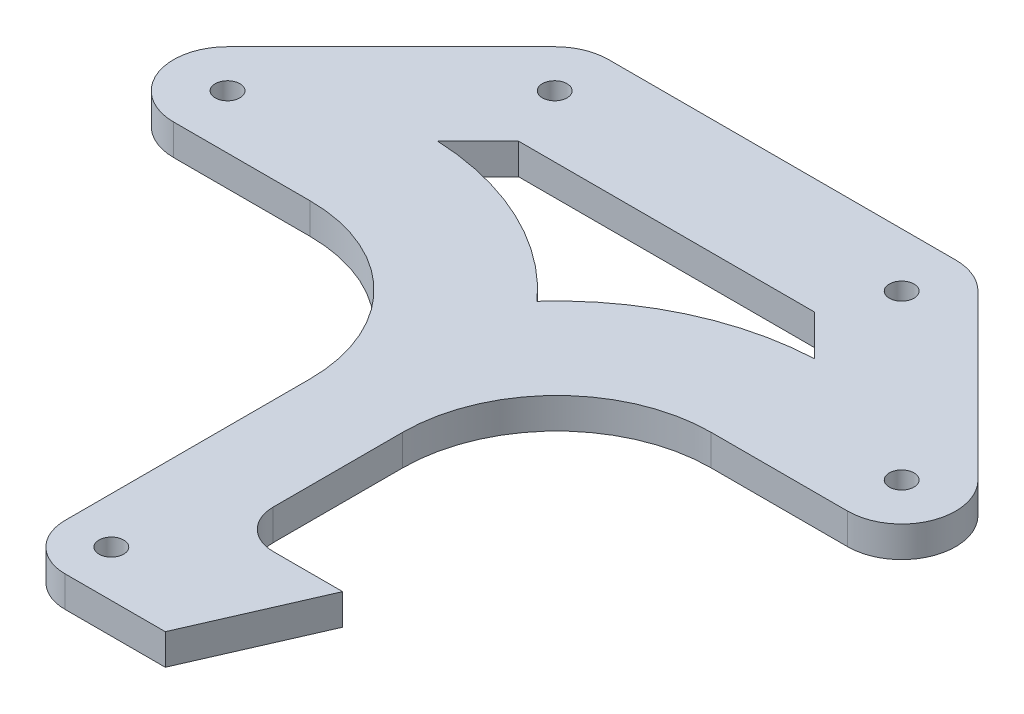
ISO-10303-21;
HEADER;
FILE_DESCRIPTION(('STEP AP214'),'2;1');
FILE_NAME('part.step','',(''),(''),'','','');
FILE_SCHEMA(('AUTOMOTIVE_DESIGN { 1 0 10303 214 1 1 1 1 }'));
ENDSEC;
DATA;
#1=APPLICATION_CONTEXT('core data for automotive mechanical design processes');
#2=APPLICATION_PROTOCOL_DEFINITION('international standard','automotive_design',2000,#1);
#3=PRODUCT_CONTEXT('',#1,'mechanical');
#4=PRODUCT('Part','Part','',(#3));
#5=PRODUCT_RELATED_PRODUCT_CATEGORY('part','',(#4));
#6=PRODUCT_DEFINITION_FORMATION('','',#4);
#7=PRODUCT_DEFINITION_CONTEXT('part definition',#1,'design');
#8=PRODUCT_DEFINITION('design','',#6,#7);
#9=PRODUCT_DEFINITION_SHAPE('','',#8);
#10=(LENGTH_UNIT() NAMED_UNIT(*) SI_UNIT(.MILLI.,.METRE.));
#11=(NAMED_UNIT(*) PLANE_ANGLE_UNIT() SI_UNIT($,.RADIAN.));
#12=(NAMED_UNIT(*) SI_UNIT($,.STERADIAN.) SOLID_ANGLE_UNIT());
#13=UNCERTAINTY_MEASURE_WITH_UNIT(LENGTH_MEASURE(1.E-05),#10,'distance_accuracy_value','');
#14=(GEOMETRIC_REPRESENTATION_CONTEXT(3) GLOBAL_UNCERTAINTY_ASSIGNED_CONTEXT((#13)) GLOBAL_UNIT_ASSIGNED_CONTEXT((#10,
#11,#12)) REPRESENTATION_CONTEXT('',''));
#15=CARTESIAN_POINT('',(0.,0.,0.));
#16=DIRECTION('',(0.,0.,1.));
#17=DIRECTION('',(1.,0.,0.));
#18=AXIS2_PLACEMENT_3D('',#15,#16,#17);
#19=CARTESIAN_POINT('',(0.,4.,-10.));
#20=DIRECTION('',(0.,0.,-1.));
#21=DIRECTION('',(-1.,0.,0.));
#22=AXIS2_PLACEMENT_3D('',#19,#20,#21);
#23=PLANE('',#22);
#24=DIRECTION('',(1.,0.,0.));
#25=VECTOR('',#24,1.);
#26=CARTESIAN_POINT('',(0.,0.,-10.));
#27=LINE('',#26,#25);
#28=CARTESIAN_POINT('',(11.,0.,-10.));
#29=VERTEX_POINT('',#28);
#30=CARTESIAN_POINT('',(20.,0.,-10.));
#31=VERTEX_POINT('',#30);
#32=EDGE_CURVE('E258',#29,#31,#27,.T.);
#33=ORIENTED_EDGE('',*,*,#32,.F.);
#34=DIRECTION('',(0.,-1.,0.));
#35=VECTOR('',#34,1.);
#36=CARTESIAN_POINT('',(11.,4.,-10.));
#37=LINE('',#36,#35);
#38=CARTESIAN_POINT('',(11.,4.,-10.));
#39=VERTEX_POINT('',#38);
#40=EDGE_CURVE('E11',#39,#29,#37,.T.);
#41=ORIENTED_EDGE('',*,*,#40,.F.);
#42=DIRECTION('',(1.,0.,0.));
#43=VECTOR('',#42,1.);
#44=CARTESIAN_POINT('',(0.,4.,-10.));
#45=LINE('',#44,#43);
#46=CARTESIAN_POINT('',(20.,4.,-10.));
#47=VERTEX_POINT('',#46);
#48=EDGE_CURVE('E390',#39,#47,#45,.T.);
#49=ORIENTED_EDGE('',*,*,#48,.T.);
#50=DIRECTION('',(0.,-1.,0.));
#51=VECTOR('',#50,1.);
#52=CARTESIAN_POINT('',(20.,4.,-10.));
#53=LINE('',#52,#51);
#54=EDGE_CURVE('E56',#47,#31,#53,.T.);
#55=ORIENTED_EDGE('',*,*,#54,.T.);
#56=EDGE_LOOP('',(#33,#41,#49,#55));
#57=FACE_BOUND('',#56,.T.);
#58=ADVANCED_FACE('F37',(#57),#23,.T.);
#59=CARTESIAN_POINT('',(11.,4.,-15.));
#60=DIRECTION('',(0.,-1.,0.));
#61=DIRECTION('',(0.,0.,-1.));
#62=AXIS2_PLACEMENT_3D('',#59,#60,#61);
#63=CYLINDRICAL_SURFACE('',#62,5.);
#64=CARTESIAN_POINT('',(11.,0.,-15.));
#65=DIRECTION('',(0.,1.,0.));
#66=DIRECTION('',(0.,0.,1.));
#67=AXIS2_PLACEMENT_3D('',#64,#65,#66);
#68=CIRCLE('',#67,5.);
#69=CARTESIAN_POINT('',(6.00000000000001,0.,-15.));
#70=VERTEX_POINT('',#69);
#71=EDGE_CURVE('E260',#29,#70,#68,.F.);
#72=ORIENTED_EDGE('',*,*,#71,.T.);
#73=DIRECTION('',(0.,-1.,0.));
#74=VECTOR('',#73,1.);
#75=CARTESIAN_POINT('',(6.00000000000001,4.,-15.));
#76=LINE('',#75,#74);
#77=CARTESIAN_POINT('',(6.00000000000001,4.,-15.));
#78=VERTEX_POINT('',#77);
#79=EDGE_CURVE('E47',#78,#70,#76,.T.);
#80=ORIENTED_EDGE('',*,*,#79,.F.);
#81=CARTESIAN_POINT('',(11.,4.,-15.));
#82=DIRECTION('',(0.,1.,0.));
#83=DIRECTION('',(0.,0.,1.));
#84=AXIS2_PLACEMENT_3D('',#81,#82,#83);
#85=CIRCLE('',#84,5.);
#86=EDGE_CURVE('E396',#39,#78,#85,.F.);
#87=ORIENTED_EDGE('',*,*,#86,.F.);
#88=ORIENTED_EDGE('',*,*,#40,.T.);
#89=EDGE_LOOP('',(#72,#80,#87,#88));
#90=FACE_BOUND('',#89,.T.);
#91=ADVANCED_FACE('F455',(#90),#63,.F.);
#92=CARTESIAN_POINT('',(6.00000000000002,4.,0.));
#93=DIRECTION('',(1.,0.,0.));
#94=DIRECTION('',(0.,0.,-1.));
#95=AXIS2_PLACEMENT_3D('',#92,#93,#94);
#96=PLANE('',#95);
#97=DIRECTION('',(0.,0.,1.));
#98=VECTOR('',#97,1.);
#99=CARTESIAN_POINT('',(6.00000000000002,0.,0.));
#100=LINE('',#99,#98);
#101=CARTESIAN_POINT('',(6.,0.,-31.7867965644037));
#102=VERTEX_POINT('',#101);
#103=EDGE_CURVE('E263',#102,#70,#100,.T.);
#104=ORIENTED_EDGE('',*,*,#103,.F.);
#105=DIRECTION('',(0.,-1.,0.));
#106=VECTOR('',#105,1.);
#107=CARTESIAN_POINT('',(6.,4.,-31.7867965644037));
#108=LINE('',#107,#106);
#109=CARTESIAN_POINT('',(6.,4.,-31.7867965644037));
#110=VERTEX_POINT('',#109);
#111=EDGE_CURVE('E352',#110,#102,#108,.T.);
#112=ORIENTED_EDGE('',*,*,#111,.F.);
#113=DIRECTION('',(0.,0.,1.));
#114=VECTOR('',#113,1.);
#115=CARTESIAN_POINT('',(6.00000000000002,4.,0.));
#116=LINE('',#115,#114);
#117=EDGE_CURVE('E398',#110,#78,#116,.T.);
#118=ORIENTED_EDGE('',*,*,#117,.T.);
#119=ORIENTED_EDGE('',*,*,#79,.T.);
#120=EDGE_LOOP('',(#104,#112,#118,#119));
#121=FACE_BOUND('',#120,.T.);
#122=ADVANCED_FACE('F460',(#121),#96,.T.);
#123=CARTESIAN_POINT('',(26.,4.,-31.7867965644037));
#124=DIRECTION('',(0.,-1.,0.));
#125=DIRECTION('',(0.,0.,-1.));
#126=AXIS2_PLACEMENT_3D('',#123,#124,#125);
#127=CYLINDRICAL_SURFACE('',#126,20.);
#128=CARTESIAN_POINT('',(26.,0.,-31.7867965644037));
#129=DIRECTION('',(0.,1.,0.));
#130=DIRECTION('',(0.,0.,1.));
#131=AXIS2_PLACEMENT_3D('',#128,#129,#130);
#132=CIRCLE('',#131,20.);
#133=CARTESIAN_POINT('',(26.,0.,-51.7867965644037));
#134=VERTEX_POINT('',#133);
#135=EDGE_CURVE('E266',#134,#102,#132,.T.);
#136=ORIENTED_EDGE('',*,*,#135,.F.);
#137=DIRECTION('',(0.,-1.,0.));
#138=VECTOR('',#137,1.);
#139=CARTESIAN_POINT('',(26.,4.,-51.7867965644037));
#140=LINE('',#139,#138);
#141=CARTESIAN_POINT('',(26.,4.,-51.7867965644037));
#142=VERTEX_POINT('',#141);
#143=EDGE_CURVE('E350',#142,#134,#140,.T.);
#144=ORIENTED_EDGE('',*,*,#143,.F.);
#145=CARTESIAN_POINT('',(26.,4.,-31.7867965644037));
#146=DIRECTION('',(0.,1.,0.));
#147=DIRECTION('',(0.,0.,1.));
#148=AXIS2_PLACEMENT_3D('',#145,#146,#147);
#149=CIRCLE('',#148,20.);
#150=EDGE_CURVE('E401',#142,#110,#149,.T.);
#151=ORIENTED_EDGE('',*,*,#150,.T.);
#152=ORIENTED_EDGE('',*,*,#111,.T.);
#153=EDGE_LOOP('',(#136,#144,#151,#152));
#154=FACE_BOUND('',#153,.T.);
#155=ADVANCED_FACE('F699',(#154),#127,.F.);
#156=CARTESIAN_POINT('',(0.,4.,-51.7867965644037));
#157=DIRECTION('',(0.,0.,-1.));
#158=DIRECTION('',(-1.,0.,0.));
#159=AXIS2_PLACEMENT_3D('',#156,#157,#158);
#160=PLANE('',#159);
#161=DIRECTION('',(1.,0.,0.));
#162=VECTOR('',#161,1.);
#163=CARTESIAN_POINT('',(0.,0.,-51.7867965644037));
#164=LINE('',#163,#162);
#165=CARTESIAN_POINT('',(43.7132034355966,0.,-51.7867965644037));
#166=VERTEX_POINT('',#165);
#167=EDGE_CURVE('E269',#134,#166,#164,.T.);
#168=ORIENTED_EDGE('',*,*,#167,.T.);
#169=DIRECTION('',(0.,-1.,0.));
#170=VECTOR('',#169,1.);
#171=CARTESIAN_POINT('',(43.7132034355966,4.,-51.7867965644037));
#172=LINE('',#171,#170);
#173=CARTESIAN_POINT('',(43.7132034355966,4.,-51.7867965644037));
#174=VERTEX_POINT('',#173);
#175=EDGE_CURVE('E347',#174,#166,#172,.T.);
#176=ORIENTED_EDGE('',*,*,#175,.F.);
#177=DIRECTION('',(1.,0.,0.));
#178=VECTOR('',#177,1.);
#179=CARTESIAN_POINT('',(0.,4.,-51.7867965644037));
#180=LINE('',#179,#178);
#181=EDGE_CURVE('E404',#142,#174,#180,.T.);
#182=ORIENTED_EDGE('',*,*,#181,.F.);
#183=ORIENTED_EDGE('',*,*,#143,.T.);
#184=EDGE_LOOP('',(#168,#176,#182,#183));
#185=FACE_BOUND('',#184,.T.);
#186=ADVANCED_FACE('F690',(#185),#160,.F.);
#187=CARTESIAN_POINT('',(43.7132034355966,4.,-58.7867965644037));
#188=DIRECTION('',(0.,-1.,0.));
#189=DIRECTION('',(0.,0.,-1.));
#190=AXIS2_PLACEMENT_3D('',#187,#188,#189);
#191=CYLINDRICAL_SURFACE('',#190,7.00000000000003);
#192=CARTESIAN_POINT('',(43.7132034355966,0.,-58.7867965644037));
#193=DIRECTION('',(0.,1.,0.));
#194=DIRECTION('',(0.,0.,1.));
#195=AXIS2_PLACEMENT_3D('',#192,#193,#194);
#196=CIRCLE('',#195,7.00000000000003);
#197=CARTESIAN_POINT('',(48.6629509039024,0.,-63.7365440327096));
#198=VERTEX_POINT('',#197);
#199=EDGE_CURVE('E272',#166,#198,#196,.T.);
#200=ORIENTED_EDGE('',*,*,#199,.T.);
#201=DIRECTION('',(0.,-1.,0.));
#202=VECTOR('',#201,1.);
#203=CARTESIAN_POINT('',(48.6629509039024,4.,-63.7365440327096));
#204=LINE('',#203,#202);
#205=CARTESIAN_POINT('',(48.6629509039024,4.,-63.7365440327096));
#206=VERTEX_POINT('',#205);
#207=EDGE_CURVE('E344',#206,#198,#204,.T.);
#208=ORIENTED_EDGE('',*,*,#207,.F.);
#209=CARTESIAN_POINT('',(43.7132034355966,4.,-58.7867965644037));
#210=DIRECTION('',(0.,1.,0.));
#211=DIRECTION('',(0.,0.,1.));
#212=AXIS2_PLACEMENT_3D('',#209,#210,#211);
#213=CIRCLE('',#212,7.00000000000003);
#214=EDGE_CURVE('E407',#174,#206,#213,.T.);
#215=ORIENTED_EDGE('',*,*,#214,.F.);
#216=ORIENTED_EDGE('',*,*,#175,.T.);
#217=EDGE_LOOP('',(#200,#208,#215,#216));
#218=FACE_BOUND('',#217,.T.);
#219=ADVANCED_FACE('F681',(#218),#191,.T.);
#220=CARTESIAN_POINT('',(56.1997474683056,4.,-56.1997474683065));
#221=DIRECTION('',(-0.707106781186542,0.,0.707106781186553));
#222=DIRECTION('',(0.707106781186553,0.,0.707106781186542));
#223=AXIS2_PLACEMENT_3D('',#220,#221,#222);
#224=PLANE('',#223);
#225=DIRECTION('',(-0.707106781186553,0.,-0.707106781186542));
#226=VECTOR('',#225,1.);
#227=CARTESIAN_POINT('',(56.1997474683056,0.,-56.1997474683065));
#228=LINE('',#227,#226);
#229=CARTESIAN_POINT('',(27.4497474683058,0.,-84.9497474683058));
#230=VERTEX_POINT('',#229);
#231=EDGE_CURVE('E275',#198,#230,#228,.T.);
#232=ORIENTED_EDGE('',*,*,#231,.T.);
#233=DIRECTION('',(0.,-1.,0.));
#234=VECTOR('',#233,1.);
#235=CARTESIAN_POINT('',(27.4497474683058,4.,-84.9497474683058));
#236=LINE('',#235,#234);
#237=CARTESIAN_POINT('',(27.4497474683058,4.,-84.9497474683058));
#238=VERTEX_POINT('',#237);
#239=EDGE_CURVE('E341',#238,#230,#236,.T.);
#240=ORIENTED_EDGE('',*,*,#239,.F.);
#241=DIRECTION('',(-0.707106781186553,0.,-0.707106781186542));
#242=VECTOR('',#241,1.);
#243=CARTESIAN_POINT('',(56.1997474683056,4.,-56.1997474683065));
#244=LINE('',#243,#242);
#245=EDGE_CURVE('E410',#206,#238,#244,.T.);
#246=ORIENTED_EDGE('',*,*,#245,.F.);
#247=ORIENTED_EDGE('',*,*,#207,.T.);
#248=EDGE_LOOP('',(#232,#240,#246,#247));
#249=FACE_BOUND('',#248,.T.);
#250=ADVANCED_FACE('F672',(#249),#224,.F.);
#251=CARTESIAN_POINT('',(22.5,4.,-80.));
#252=DIRECTION('',(0.,-1.,0.));
#253=DIRECTION('',(0.,0.,-1.));
#254=AXIS2_PLACEMENT_3D('',#251,#252,#253);
#255=CYLINDRICAL_SURFACE('',#254,6.99999999999997);
#256=CARTESIAN_POINT('',(22.5,0.,-80.));
#257=DIRECTION('',(0.,1.,0.));
#258=DIRECTION('',(0.,0.,1.));
#259=AXIS2_PLACEMENT_3D('',#256,#257,#258);
#260=CIRCLE('',#259,6.99999999999997);
#261=CARTESIAN_POINT('',(22.5,0.,-87.));
#262=VERTEX_POINT('',#261);
#263=EDGE_CURVE('E278',#230,#262,#260,.T.);
#264=ORIENTED_EDGE('',*,*,#263,.T.);
#265=DIRECTION('',(0.,-1.,0.));
#266=VECTOR('',#265,1.);
#267=CARTESIAN_POINT('',(22.5,4.,-87.));
#268=LINE('',#267,#266);
#269=CARTESIAN_POINT('',(22.5,4.,-87.));
#270=VERTEX_POINT('',#269);
#271=EDGE_CURVE('E339',#270,#262,#268,.T.);
#272=ORIENTED_EDGE('',*,*,#271,.F.);
#273=CARTESIAN_POINT('',(22.5,4.,-80.));
#274=DIRECTION('',(0.,1.,0.));
#275=DIRECTION('',(0.,0.,1.));
#276=AXIS2_PLACEMENT_3D('',#273,#274,#275);
#277=CIRCLE('',#276,6.99999999999997);
#278=EDGE_CURVE('E413',#238,#270,#277,.T.);
#279=ORIENTED_EDGE('',*,*,#278,.F.);
#280=ORIENTED_EDGE('',*,*,#239,.T.);
#281=EDGE_LOOP('',(#264,#272,#279,#280));
#282=FACE_BOUND('',#281,.T.);
#283=ADVANCED_FACE('F663',(#282),#255,.T.);
#284=CARTESIAN_POINT('',(0.,4.,-87.));
#285=DIRECTION('',(0.,0.,-1.));
#286=DIRECTION('',(-1.,0.,0.));
#287=AXIS2_PLACEMENT_3D('',#284,#285,#286);
#288=PLANE('',#287);
#289=DIRECTION('',(1.,0.,0.));
#290=VECTOR('',#289,1.);
#291=CARTESIAN_POINT('',(0.,0.,-87.));
#292=LINE('',#291,#290);
#293=CARTESIAN_POINT('',(-22.5,0.,-87.));
#294=VERTEX_POINT('',#293);
#295=EDGE_CURVE('E281',#294,#262,#292,.T.);
#296=ORIENTED_EDGE('',*,*,#295,.F.);
#297=DIRECTION('',(0.,-1.,0.));
#298=VECTOR('',#297,1.);
#299=CARTESIAN_POINT('',(-22.5,4.,-87.));
#300=LINE('',#299,#298);
#301=CARTESIAN_POINT('',(-22.5,4.,-87.));
#302=VERTEX_POINT('',#301);
#303=EDGE_CURVE('E337',#302,#294,#300,.T.);
#304=ORIENTED_EDGE('',*,*,#303,.F.);
#305=DIRECTION('',(1.,0.,0.));
#306=VECTOR('',#305,1.);
#307=CARTESIAN_POINT('',(0.,4.,-87.));
#308=LINE('',#307,#306);
#309=EDGE_CURVE('E415',#302,#270,#308,.T.);
#310=ORIENTED_EDGE('',*,*,#309,.T.);
#311=ORIENTED_EDGE('',*,*,#271,.T.);
#312=EDGE_LOOP('',(#296,#304,#310,#311));
#313=FACE_BOUND('',#312,.T.);
#314=ADVANCED_FACE('F654',(#313),#288,.T.);
#315=CARTESIAN_POINT('',(-22.5,4.,-80.));
#316=DIRECTION('',(0.,-1.,0.));
#317=DIRECTION('',(0.,0.,-1.));
#318=AXIS2_PLACEMENT_3D('',#315,#316,#317);
#319=CYLINDRICAL_SURFACE('',#318,6.99999999999997);
#320=CARTESIAN_POINT('',(-22.5,0.,-80.));
#321=DIRECTION('',(0.,1.,0.));
#322=DIRECTION('',(0.,0.,1.));
#323=AXIS2_PLACEMENT_3D('',#320,#321,#322);
#324=CIRCLE('',#323,6.99999999999997);
#325=CARTESIAN_POINT('',(-27.4497474683058,0.,-84.9497474683058));
#326=VERTEX_POINT('',#325);
#327=EDGE_CURVE('E284',#326,#294,#324,.F.);
#328=ORIENTED_EDGE('',*,*,#327,.F.);
#329=DIRECTION('',(0.,-1.,0.));
#330=VECTOR('',#329,1.);
#331=CARTESIAN_POINT('',(-27.4497474683058,4.,-84.9497474683058));
#332=LINE('',#331,#330);
#333=CARTESIAN_POINT('',(-27.4497474683058,4.,-84.9497474683058));
#334=VERTEX_POINT('',#333);
#335=EDGE_CURVE('E335',#334,#326,#332,.T.);
#336=ORIENTED_EDGE('',*,*,#335,.F.);
#337=CARTESIAN_POINT('',(-22.5,4.,-80.));
#338=DIRECTION('',(0.,1.,0.));
#339=DIRECTION('',(0.,0.,1.));
#340=AXIS2_PLACEMENT_3D('',#337,#338,#339);
#341=CIRCLE('',#340,6.99999999999997);
#342=EDGE_CURVE('E418',#334,#302,#341,.F.);
#343=ORIENTED_EDGE('',*,*,#342,.T.);
#344=ORIENTED_EDGE('',*,*,#303,.T.);
#345=EDGE_LOOP('',(#328,#336,#343,#344));
#346=FACE_BOUND('',#345,.T.);
#347=ADVANCED_FACE('F645',(#346),#319,.T.);
#348=CARTESIAN_POINT('',(-56.1997474683056,4.,-56.1997474683065));
#349=DIRECTION('',(-0.707106781186542,0.,-0.707106781186553));
#350=DIRECTION('',(-0.707106781186553,0.,0.707106781186542));
#351=AXIS2_PLACEMENT_3D('',#348,#349,#350);
#352=PLANE('',#351);
#353=DIRECTION('',(0.707106781186553,0.,-0.707106781186542));
#354=VECTOR('',#353,1.);
#355=CARTESIAN_POINT('',(-56.1997474683056,0.,-56.1997474683065));
#356=LINE('',#355,#354);
#357=CARTESIAN_POINT('',(-48.6629509039024,0.,-63.7365440327096));
#358=VERTEX_POINT('',#357);
#359=EDGE_CURVE('E287',#358,#326,#356,.T.);
#360=ORIENTED_EDGE('',*,*,#359,.F.);
#361=DIRECTION('',(0.,-1.,0.));
#362=VECTOR('',#361,1.);
#363=CARTESIAN_POINT('',(-48.6629509039024,4.,-63.7365440327096));
#364=LINE('',#363,#362);
#365=CARTESIAN_POINT('',(-48.6629509039024,4.,-63.7365440327096));
#366=VERTEX_POINT('',#365);
#367=EDGE_CURVE('E333',#366,#358,#364,.T.);
#368=ORIENTED_EDGE('',*,*,#367,.F.);
#369=DIRECTION('',(0.707106781186553,0.,-0.707106781186542));
#370=VECTOR('',#369,1.);
#371=CARTESIAN_POINT('',(-56.1997474683056,4.,-56.1997474683065));
#372=LINE('',#371,#370);
#373=EDGE_CURVE('E421',#366,#334,#372,.T.);
#374=ORIENTED_EDGE('',*,*,#373,.T.);
#375=ORIENTED_EDGE('',*,*,#335,.T.);
#376=EDGE_LOOP('',(#360,#368,#374,#375));
#377=FACE_BOUND('',#376,.T.);
#378=ADVANCED_FACE('F636',(#377),#352,.T.);
#379=CARTESIAN_POINT('',(-43.7132034355965,4.,-58.7867965644037));
#380=DIRECTION('',(0.,-1.,0.));
#381=DIRECTION('',(0.,0.,-1.));
#382=AXIS2_PLACEMENT_3D('',#379,#380,#381);
#383=CYLINDRICAL_SURFACE('',#382,7.00000000000005);
#384=CARTESIAN_POINT('',(-43.7132034355965,0.,-58.7867965644037));
#385=DIRECTION('',(0.,1.,0.));
#386=DIRECTION('',(0.,0.,1.));
#387=AXIS2_PLACEMENT_3D('',#384,#385,#386);
#388=CIRCLE('',#387,7.00000000000005);
#389=CARTESIAN_POINT('',(-43.7132034355966,0.,-51.7867965644037));
#390=VERTEX_POINT('',#389);
#391=EDGE_CURVE('E290',#390,#358,#388,.F.);
#392=ORIENTED_EDGE('',*,*,#391,.F.);
#393=DIRECTION('',(0.,-1.,0.));
#394=VECTOR('',#393,1.);
#395=CARTESIAN_POINT('',(-43.7132034355966,4.,-51.7867965644037));
#396=LINE('',#395,#394);
#397=CARTESIAN_POINT('',(-43.7132034355966,4.,-51.7867965644037));
#398=VERTEX_POINT('',#397);
#399=EDGE_CURVE('E331',#398,#390,#396,.T.);
#400=ORIENTED_EDGE('',*,*,#399,.F.);
#401=CARTESIAN_POINT('',(-43.7132034355965,4.,-58.7867965644037));
#402=DIRECTION('',(0.,1.,0.));
#403=DIRECTION('',(0.,0.,1.));
#404=AXIS2_PLACEMENT_3D('',#401,#402,#403);
#405=CIRCLE('',#404,7.00000000000005);
#406=EDGE_CURVE('E424',#398,#366,#405,.F.);
#407=ORIENTED_EDGE('',*,*,#406,.T.);
#408=ORIENTED_EDGE('',*,*,#367,.T.);
#409=EDGE_LOOP('',(#392,#400,#407,#408));
#410=FACE_BOUND('',#409,.T.);
#411=ADVANCED_FACE('F628',(#410),#383,.T.);
#412=CARTESIAN_POINT('',(0.,4.,-51.7867965644037));
#413=DIRECTION('',(0.,0.,-1.));
#414=DIRECTION('',(-1.,0.,0.));
#415=AXIS2_PLACEMENT_3D('',#412,#413,#414);
#416=PLANE('',#415);
#417=DIRECTION('',(1.,0.,0.));
#418=VECTOR('',#417,1.);
#419=CARTESIAN_POINT('',(0.,0.,-51.7867965644037));
#420=LINE('',#419,#418);
#421=CARTESIAN_POINT('',(-26.,0.,-51.7867965644037));
#422=VERTEX_POINT('',#421);
#423=EDGE_CURVE('E293',#390,#422,#420,.T.);
#424=ORIENTED_EDGE('',*,*,#423,.T.);
#425=DIRECTION('',(0.,-1.,0.));
#426=VECTOR('',#425,1.);
#427=CARTESIAN_POINT('',(-26.,4.,-51.7867965644037));
#428=LINE('',#427,#426);
#429=CARTESIAN_POINT('',(-26.,4.,-51.7867965644037));
#430=VERTEX_POINT('',#429);
#431=EDGE_CURVE('E329',#430,#422,#428,.T.);
#432=ORIENTED_EDGE('',*,*,#431,.F.);
#433=DIRECTION('',(1.,0.,0.));
#434=VECTOR('',#433,1.);
#435=CARTESIAN_POINT('',(0.,4.,-51.7867965644037));
#436=LINE('',#435,#434);
#437=EDGE_CURVE('E427',#398,#430,#436,.T.);
#438=ORIENTED_EDGE('',*,*,#437,.F.);
#439=ORIENTED_EDGE('',*,*,#399,.T.);
#440=EDGE_LOOP('',(#424,#432,#438,#439));
#441=FACE_BOUND('',#440,.T.);
#442=ADVANCED_FACE('F439',(#441),#416,.F.);
#443=CARTESIAN_POINT('',(-26.,4.,-31.7867965644037));
#444=DIRECTION('',(0.,-1.,0.));
#445=DIRECTION('',(0.,0.,-1.));
#446=AXIS2_PLACEMENT_3D('',#443,#444,#445);
#447=CYLINDRICAL_SURFACE('',#446,20.);
#448=CARTESIAN_POINT('',(-26.,0.,-31.7867965644037));
#449=DIRECTION('',(0.,1.,0.));
#450=DIRECTION('',(0.,0.,1.));
#451=AXIS2_PLACEMENT_3D('',#448,#449,#450);
#452=CIRCLE('',#451,20.);
#453=CARTESIAN_POINT('',(-6.,0.,-31.7867965644037));
#454=VERTEX_POINT('',#453);
#455=EDGE_CURVE('E296',#454,#422,#452,.T.);
#456=ORIENTED_EDGE('',*,*,#455,.F.);
#457=DIRECTION('',(0.,-1.,0.));
#458=VECTOR('',#457,1.);
#459=CARTESIAN_POINT('',(-6.,4.,-31.7867965644037));
#460=LINE('',#459,#458);
#461=CARTESIAN_POINT('',(-6.,4.,-31.7867965644037));
#462=VERTEX_POINT('',#461);
#463=EDGE_CURVE('E327',#462,#454,#460,.T.);
#464=ORIENTED_EDGE('',*,*,#463,.F.);
#465=CARTESIAN_POINT('',(-26.,4.,-31.7867965644037));
#466=DIRECTION('',(0.,1.,0.));
#467=DIRECTION('',(0.,0.,1.));
#468=AXIS2_PLACEMENT_3D('',#465,#466,#467);
#469=CIRCLE('',#468,20.);
#470=EDGE_CURVE('E429',#462,#430,#469,.T.);
#471=ORIENTED_EDGE('',*,*,#470,.T.);
#472=ORIENTED_EDGE('',*,*,#431,.T.);
#473=EDGE_LOOP('',(#456,#464,#471,#472));
#474=FACE_BOUND('',#473,.T.);
#475=ADVANCED_FACE('F433',(#474),#447,.F.);
#476=CARTESIAN_POINT('',(-5.99999999999999,4.,0.));
#477=DIRECTION('',(1.,0.,0.));
#478=DIRECTION('',(0.,0.,-1.));
#479=AXIS2_PLACEMENT_3D('',#476,#477,#478);
#480=PLANE('',#479);
#481=DIRECTION('',(0.,0.,1.));
#482=VECTOR('',#481,1.);
#483=CARTESIAN_POINT('',(-5.99999999999999,0.,0.));
#484=LINE('',#483,#482);
#485=CARTESIAN_POINT('',(-5.99999999999999,0.,0.));
#486=VERTEX_POINT('',#485);
#487=EDGE_CURVE('E299',#454,#486,#484,.T.);
#488=ORIENTED_EDGE('',*,*,#487,.T.);
#489=DIRECTION('',(0.,-1.,0.));
#490=VECTOR('',#489,1.);
#491=CARTESIAN_POINT('',(-5.99999999999999,4.,0.));
#492=LINE('',#491,#490);
#493=CARTESIAN_POINT('',(-5.99999999999999,4.,0.));
#494=VERTEX_POINT('',#493);
#495=EDGE_CURVE('E221',#494,#486,#492,.T.);
#496=ORIENTED_EDGE('',*,*,#495,.F.);
#497=DIRECTION('',(0.,0.,1.));
#498=VECTOR('',#497,1.);
#499=CARTESIAN_POINT('',(-5.99999999999999,4.,0.));
#500=LINE('',#499,#498);
#501=EDGE_CURVE('E210',#462,#494,#500,.T.);
#502=ORIENTED_EDGE('',*,*,#501,.F.);
#503=ORIENTED_EDGE('',*,*,#463,.T.);
#504=EDGE_LOOP('',(#488,#496,#502,#503));
#505=FACE_BOUND('',#504,.T.);
#506=ADVANCED_FACE('F445',(#505),#480,.F.);
#507=CARTESIAN_POINT('',(0.,4.,0.));
#508=DIRECTION('',(0.,-1.,0.));
#509=DIRECTION('',(0.,0.,-1.));
#510=AXIS2_PLACEMENT_3D('',#507,#508,#509);
#511=CYLINDRICAL_SURFACE('',#510,6.);
#512=CARTESIAN_POINT('',(0.,0.,0.));
#513=DIRECTION('',(0.,1.,0.));
#514=DIRECTION('',(0.,0.,1.));
#515=AXIS2_PLACEMENT_3D('',#512,#513,#514);
#516=CIRCLE('',#515,6.);
#517=CARTESIAN_POINT('',(0.,0.,6.));
#518=VERTEX_POINT('',#517);
#519=EDGE_CURVE('E218',#486,#518,#516,.T.);
#520=ORIENTED_EDGE('',*,*,#519,.T.);
#521=DIRECTION('',(0.,-1.,0.));
#522=VECTOR('',#521,1.);
#523=CARTESIAN_POINT('',(0.,4.,6.));
#524=LINE('',#523,#522);
#525=CARTESIAN_POINT('',(0.,4.,6.));
#526=VERTEX_POINT('',#525);
#527=EDGE_CURVE('E216',#526,#518,#524,.T.);
#528=ORIENTED_EDGE('',*,*,#527,.F.);
#529=CARTESIAN_POINT('',(0.,4.,0.));
#530=DIRECTION('',(0.,1.,0.));
#531=DIRECTION('',(0.,0.,1.));
#532=AXIS2_PLACEMENT_3D('',#529,#530,#531);
#533=CIRCLE('',#532,6.);
#534=EDGE_CURVE('E200',#494,#526,#533,.T.);
#535=ORIENTED_EDGE('',*,*,#534,.F.);
#536=ORIENTED_EDGE('',*,*,#495,.T.);
#537=EDGE_LOOP('',(#520,#528,#535,#536));
#538=FACE_BOUND('',#537,.T.);
#539=ADVANCED_FACE('F217',(#538),#511,.T.);
#540=CARTESIAN_POINT('',(0.,4.,6.));
#541=DIRECTION('',(0.,0.,1.));
#542=DIRECTION('',(1.,0.,0.));
#543=AXIS2_PLACEMENT_3D('',#540,#541,#542);
#544=PLANE('',#543);
#545=DIRECTION('',(-1.,0.,0.));
#546=VECTOR('',#545,1.);
#547=CARTESIAN_POINT('',(0.,0.,6.));
#548=LINE('',#547,#546);
#549=CARTESIAN_POINT('',(13.,0.,6.));
#550=VERTEX_POINT('',#549);
#551=EDGE_CURVE('E303',#550,#518,#548,.T.);
#552=ORIENTED_EDGE('',*,*,#551,.F.);
#553=DIRECTION('',(0.,-1.,0.));
#554=VECTOR('',#553,1.);
#555=CARTESIAN_POINT('',(13.,4.,6.));
#556=LINE('',#555,#554);
#557=CARTESIAN_POINT('',(13.,4.,6.));
#558=VERTEX_POINT('',#557);
#559=EDGE_CURVE('E126',#558,#550,#556,.T.);
#560=ORIENTED_EDGE('',*,*,#559,.F.);
#561=DIRECTION('',(-1.,0.,0.));
#562=VECTOR('',#561,1.);
#563=CARTESIAN_POINT('',(0.,4.,6.));
#564=LINE('',#563,#562);
#565=EDGE_CURVE('E207',#558,#526,#564,.T.);
#566=ORIENTED_EDGE('',*,*,#565,.T.);
#567=ORIENTED_EDGE('',*,*,#527,.T.);
#568=EDGE_LOOP('',(#552,#560,#566,#567));
#569=FACE_BOUND('',#568,.T.);
#570=ADVANCED_FACE('F223',(#569),#544,.T.);
#571=CARTESIAN_POINT('',(26.,4.,-31.7867965644037));
#572=DIRECTION('',(0.,-1.,0.));
#573=DIRECTION('',(0.,0.,-1.));
#574=AXIS2_PLACEMENT_3D('',#571,#572,#573);
#575=CYLINDRICAL_SURFACE('',#574,35.);
#576=CARTESIAN_POINT('',(26.,0.,-31.7867965644037));
#577=DIRECTION('',(0.,1.,0.));
#578=DIRECTION('',(0.,0.,1.));
#579=AXIS2_PLACEMENT_3D('',#576,#577,#578);
#580=CIRCLE('',#579,35.);
#581=CARTESIAN_POINT('',(24.4345227367343,0.,-66.7517687642811));
#582=VERTEX_POINT('',#581);
#583=CARTESIAN_POINT('',(0.,0.,-55.2175455921237));
#584=VERTEX_POINT('',#583);
#585=EDGE_CURVE('E245',#582,#584,#580,.T.);
#586=ORIENTED_EDGE('',*,*,#585,.T.);
#587=DIRECTION('',(0.,-1.,0.));
#588=VECTOR('',#587,1.);
#589=CARTESIAN_POINT('',(0.,4.,-55.2175455921237));
#590=LINE('',#589,#588);
#591=CARTESIAN_POINT('',(0.,4.,-55.2175455921237));
#592=VERTEX_POINT('',#591);
#593=EDGE_CURVE('E41',#592,#584,#590,.T.);
#594=ORIENTED_EDGE('',*,*,#593,.F.);
#595=CARTESIAN_POINT('',(26.,4.,-31.7867965644037));
#596=DIRECTION('',(0.,1.,0.));
#597=DIRECTION('',(0.,0.,1.));
#598=AXIS2_PLACEMENT_3D('',#595,#596,#597);
#599=CIRCLE('',#598,35.);
#600=CARTESIAN_POINT('',(24.4345227367343,4.,-66.7517687642811));
#601=VERTEX_POINT('',#600);
#602=EDGE_CURVE('E323',#601,#592,#599,.T.);
#603=ORIENTED_EDGE('',*,*,#602,.F.);
#604=DIRECTION('',(0.,-1.,0.));
#605=VECTOR('',#604,1.);
#606=CARTESIAN_POINT('',(24.4345227367343,4.,-66.7517687642811));
#607=LINE('',#606,#605);
#608=EDGE_CURVE('E244',#601,#582,#607,.T.);
#609=ORIENTED_EDGE('',*,*,#608,.T.);
#610=EDGE_LOOP('',(#586,#594,#603,#609));
#611=FACE_BOUND('',#610,.T.);
#612=ADVANCED_FACE('F39',(#611),#575,.T.);
#613=CARTESIAN_POINT('',(-26.,4.,-31.7867965644037));
#614=DIRECTION('',(0.,-1.,0.));
#615=DIRECTION('',(0.,0.,-1.));
#616=AXIS2_PLACEMENT_3D('',#613,#614,#615);
#617=CYLINDRICAL_SURFACE('',#616,35.);
#618=CARTESIAN_POINT('',(-26.,0.,-31.7867965644037));
#619=DIRECTION('',(0.,1.,0.));
#620=DIRECTION('',(0.,0.,1.));
#621=AXIS2_PLACEMENT_3D('',#618,#619,#620);
#622=CIRCLE('',#621,35.);
#623=CARTESIAN_POINT('',(-24.4345227367343,0.,-66.7517687642811));
#624=VERTEX_POINT('',#623);
#625=EDGE_CURVE('E248',#584,#624,#622,.T.);
#626=ORIENTED_EDGE('',*,*,#625,.T.);
#627=DIRECTION('',(0.,-1.,0.));
#628=VECTOR('',#627,1.);
#629=CARTESIAN_POINT('',(-24.4345227367343,4.,-66.7517687642811));
#630=LINE('',#629,#628);
#631=CARTESIAN_POINT('',(-24.4345227367343,4.,-66.7517687642811));
#632=VERTEX_POINT('',#631);
#633=EDGE_CURVE('E360',#632,#624,#630,.T.);
#634=ORIENTED_EDGE('',*,*,#633,.F.);
#635=CARTESIAN_POINT('',(-26.,4.,-31.7867965644037));
#636=DIRECTION('',(0.,1.,0.));
#637=DIRECTION('',(0.,0.,1.));
#638=AXIS2_PLACEMENT_3D('',#635,#636,#637);
#639=CIRCLE('',#638,35.);
#640=EDGE_CURVE('E139',#592,#632,#639,.T.);
#641=ORIENTED_EDGE('',*,*,#640,.F.);
#642=ORIENTED_EDGE('',*,*,#593,.T.);
#643=EDGE_LOOP('',(#626,#634,#641,#642));
#644=FACE_BOUND('',#643,.T.);
#645=ADVANCED_FACE('F366',(#644),#617,.T.);
#646=CARTESIAN_POINT('',(-45.5931457505074,4.,-45.5931457505087));
#647=DIRECTION('',(-0.707106781186538,0.,-0.707106781186558));
#648=DIRECTION('',(-0.707106781186558,0.,0.707106781186538));
#649=AXIS2_PLACEMENT_3D('',#646,#647,#648);
#650=PLANE('',#649);
#651=DIRECTION('',(0.707106781186558,0.,-0.707106781186537));
#652=VECTOR('',#651,1.);
#653=CARTESIAN_POINT('',(-45.5931457505074,0.,-45.5931457505087));
#654=LINE('',#653,#652);
#655=CARTESIAN_POINT('',(-19.1862915010152,0.,-72.));
#656=VERTEX_POINT('',#655);
#657=EDGE_CURVE('E250',#624,#656,#654,.T.);
#658=ORIENTED_EDGE('',*,*,#657,.T.);
#659=DIRECTION('',(0.,-1.,0.));
#660=VECTOR('',#659,1.);
#661=CARTESIAN_POINT('',(-19.1862915010152,4.,-72.));
#662=LINE('',#661,#660);
#663=CARTESIAN_POINT('',(-19.1862915010152,4.,-72.));
#664=VERTEX_POINT('',#663);
#665=EDGE_CURVE('E358',#664,#656,#662,.T.);
#666=ORIENTED_EDGE('',*,*,#665,.F.);
#667=DIRECTION('',(0.707106781186558,0.,-0.707106781186537));
#668=VECTOR('',#667,1.);
#669=CARTESIAN_POINT('',(-45.5931457505074,4.,-45.5931457505087));
#670=LINE('',#669,#668);
#671=EDGE_CURVE('E386',#632,#664,#670,.T.);
#672=ORIENTED_EDGE('',*,*,#671,.F.);
#673=ORIENTED_EDGE('',*,*,#633,.T.);
#674=EDGE_LOOP('',(#658,#666,#672,#673));
#675=FACE_BOUND('',#674,.T.);
#676=ADVANCED_FACE('F385',(#675),#650,.F.);
#677=CARTESIAN_POINT('',(0.,4.,-72.));
#678=DIRECTION('',(0.,0.,-1.));
#679=DIRECTION('',(-1.,0.,0.));
#680=AXIS2_PLACEMENT_3D('',#677,#678,#679);
#681=PLANE('',#680);
#682=DIRECTION('',(1.,0.,0.));
#683=VECTOR('',#682,1.);
#684=CARTESIAN_POINT('',(0.,0.,-72.));
#685=LINE('',#684,#683);
#686=CARTESIAN_POINT('',(19.1862915010153,0.,-72.));
#687=VERTEX_POINT('',#686);
#688=EDGE_CURVE('E252',#656,#687,#685,.T.);
#689=ORIENTED_EDGE('',*,*,#688,.T.);
#690=DIRECTION('',(0.,-1.,0.));
#691=VECTOR('',#690,1.);
#692=CARTESIAN_POINT('',(19.1862915010153,4.,-72.));
#693=LINE('',#692,#691);
#694=CARTESIAN_POINT('',(19.1862915010153,4.,-72.));
#695=VERTEX_POINT('',#694);
#696=EDGE_CURVE('E356',#695,#687,#693,.T.);
#697=ORIENTED_EDGE('',*,*,#696,.F.);
#698=DIRECTION('',(1.,0.,0.));
#699=VECTOR('',#698,1.);
#700=CARTESIAN_POINT('',(0.,4.,-72.));
#701=LINE('',#700,#699);
#702=EDGE_CURVE('E387',#664,#695,#701,.T.);
#703=ORIENTED_EDGE('',*,*,#702,.F.);
#704=ORIENTED_EDGE('',*,*,#665,.T.);
#705=EDGE_LOOP('',(#689,#697,#703,#704));
#706=FACE_BOUND('',#705,.T.);
#707=ADVANCED_FACE('F383',(#706),#681,.F.);
#708=CARTESIAN_POINT('',(22.5,4.,-80.));
#709=DIRECTION('',(0.,-1.,0.));
#710=DIRECTION('',(0.,0.,-1.));
#711=AXIS2_PLACEMENT_3D('',#708,#709,#710);
#712=CYLINDRICAL_SURFACE('',#711,1.6);
#713=CARTESIAN_POINT('',(22.5,4.,-80.));
#714=DIRECTION('',(0.,1.,0.));
#715=DIRECTION('',(0.,0.,1.));
#716=AXIS2_PLACEMENT_3D('',#713,#714,#715);
#717=CIRCLE('',#716,1.6);
#718=CARTESIAN_POINT('',(22.5,4.,-78.4));
#719=VERTEX_POINT('',#718);
#720=EDGE_CURVE('E238',#719,#719,#717,.T.);
#721=ORIENTED_EDGE('',*,*,#720,.T.);
#722=EDGE_LOOP('',(#721));
#723=FACE_BOUND('',#722,.T.);
#724=CARTESIAN_POINT('',(22.5,0.,-80.));
#725=DIRECTION('',(0.,1.,0.));
#726=DIRECTION('',(0.,0.,1.));
#727=AXIS2_PLACEMENT_3D('',#724,#725,#726);
#728=CIRCLE('',#727,1.6);
#729=CARTESIAN_POINT('',(22.5,0.,-78.4));
#730=VERTEX_POINT('',#729);
#731=EDGE_CURVE('E317',#730,#730,#728,.T.);
#732=ORIENTED_EDGE('',*,*,#731,.F.);
#733=EDGE_LOOP('',(#732));
#734=FACE_BOUND('',#733,.T.);
#735=ADVANCED_FACE('F471',(#723,#734),#712,.F.);
#736=CARTESIAN_POINT('',(0.,4.,0.));
#737=DIRECTION('',(0.,-1.,0.));
#738=DIRECTION('',(0.,0.,-1.));
#739=AXIS2_PLACEMENT_3D('',#736,#737,#738);
#740=CYLINDRICAL_SURFACE('',#739,1.6);
#741=CARTESIAN_POINT('',(0.,4.,0.));
#742=DIRECTION('',(0.,1.,0.));
#743=DIRECTION('',(0.,0.,1.));
#744=AXIS2_PLACEMENT_3D('',#741,#742,#743);
#745=CIRCLE('',#744,1.6);
#746=CARTESIAN_POINT('',(0.,4.,1.60000000000001));
#747=VERTEX_POINT('',#746);
#748=EDGE_CURVE('E235',#747,#747,#745,.T.);
#749=ORIENTED_EDGE('',*,*,#748,.T.);
#750=EDGE_LOOP('',(#749));
#751=FACE_BOUND('',#750,.T.);
#752=CARTESIAN_POINT('',(0.,0.,0.));
#753=DIRECTION('',(0.,1.,0.));
#754=DIRECTION('',(0.,0.,1.));
#755=AXIS2_PLACEMENT_3D('',#752,#753,#754);
#756=CIRCLE('',#755,1.6);
#757=CARTESIAN_POINT('',(0.,0.,1.60000000000001));
#758=VERTEX_POINT('',#757);
#759=EDGE_CURVE('E314',#758,#758,#756,.T.);
#760=ORIENTED_EDGE('',*,*,#759,.F.);
#761=EDGE_LOOP('',(#760));
#762=FACE_BOUND('',#761,.T.);
#763=ADVANCED_FACE('F493',(#751,#762),#740,.F.);
#764=CARTESIAN_POINT('',(-43.7132034355965,4.,-58.7867965644037));
#765=DIRECTION('',(0.,-1.,0.));
#766=DIRECTION('',(0.,0.,-1.));
#767=AXIS2_PLACEMENT_3D('',#764,#765,#766);
#768=CYLINDRICAL_SURFACE('',#767,1.6);
#769=CARTESIAN_POINT('',(-43.7132034355965,4.,-58.7867965644037));
#770=DIRECTION('',(0.,1.,0.));
#771=DIRECTION('',(0.,0.,1.));
#772=AXIS2_PLACEMENT_3D('',#769,#770,#771);
#773=CIRCLE('',#772,1.6);
#774=CARTESIAN_POINT('',(-43.7132034355965,4.,-57.1867965644037));
#775=VERTEX_POINT('',#774);
#776=EDGE_CURVE('E232',#775,#775,#773,.T.);
#777=ORIENTED_EDGE('',*,*,#776,.T.);
#778=EDGE_LOOP('',(#777));
#779=FACE_BOUND('',#778,.T.);
#780=CARTESIAN_POINT('',(-43.7132034355965,0.,-58.7867965644037));
#781=DIRECTION('',(0.,1.,0.));
#782=DIRECTION('',(0.,0.,1.));
#783=AXIS2_PLACEMENT_3D('',#780,#781,#782);
#784=CIRCLE('',#783,1.6);
#785=CARTESIAN_POINT('',(-43.7132034355965,0.,-57.1867965644037));
#786=VERTEX_POINT('',#785);
#787=EDGE_CURVE('E311',#786,#786,#784,.T.);
#788=ORIENTED_EDGE('',*,*,#787,.F.);
#789=EDGE_LOOP('',(#788));
#790=FACE_BOUND('',#789,.T.);
#791=ADVANCED_FACE('F489',(#779,#790),#768,.F.);
#792=CARTESIAN_POINT('',(43.7132034355966,4.,-58.7867965644037));
#793=DIRECTION('',(0.,-1.,0.));
#794=DIRECTION('',(0.,0.,-1.));
#795=AXIS2_PLACEMENT_3D('',#792,#793,#794);
#796=CYLINDRICAL_SURFACE('',#795,1.6);
#797=CARTESIAN_POINT('',(43.7132034355966,4.,-58.7867965644037));
#798=DIRECTION('',(0.,1.,0.));
#799=DIRECTION('',(0.,0.,1.));
#800=AXIS2_PLACEMENT_3D('',#797,#798,#799);
#801=CIRCLE('',#800,1.6);
#802=CARTESIAN_POINT('',(43.7132034355966,4.,-57.1867965644037));
#803=VERTEX_POINT('',#802);
#804=EDGE_CURVE('E226',#803,#803,#801,.T.);
#805=ORIENTED_EDGE('',*,*,#804,.T.);
#806=EDGE_LOOP('',(#805));
#807=FACE_BOUND('',#806,.T.);
#808=CARTESIAN_POINT('',(43.7132034355966,0.,-58.7867965644037));
#809=DIRECTION('',(0.,1.,0.));
#810=DIRECTION('',(0.,0.,1.));
#811=AXIS2_PLACEMENT_3D('',#808,#809,#810);
#812=CIRCLE('',#811,1.6);
#813=CARTESIAN_POINT('',(43.7132034355966,0.,-57.1867965644037));
#814=VERTEX_POINT('',#813);
#815=EDGE_CURVE('E308',#814,#814,#812,.T.);
#816=ORIENTED_EDGE('',*,*,#815,.F.);
#817=EDGE_LOOP('',(#816));
#818=FACE_BOUND('',#817,.T.);
#819=ADVANCED_FACE('F486',(#807,#818),#796,.F.);
#820=CARTESIAN_POINT('',(13.1147540983607,4.,5.73770491803278));
#821=DIRECTION('',(0.916157334902189,0.,0.400818834019707));
#822=DIRECTION('',(0.400818834019707,0.,-0.916157334902189));
#823=AXIS2_PLACEMENT_3D('',#820,#821,#822);
#824=PLANE('',#823);
#825=DIRECTION('',(-0.400818834019707,0.,0.916157334902189));
#826=VECTOR('',#825,1.);
#827=CARTESIAN_POINT('',(13.1147540983607,0.,5.73770491803278));
#828=LINE('',#827,#826);
#829=EDGE_CURVE('E305',#31,#550,#828,.T.);
#830=ORIENTED_EDGE('',*,*,#829,.F.);
#831=ORIENTED_EDGE('',*,*,#54,.F.);
#832=DIRECTION('',(-0.400818834019707,0.,0.916157334902189));
#833=VECTOR('',#832,1.);
#834=CARTESIAN_POINT('',(13.1147540983607,4.,5.73770491803278));
#835=LINE('',#834,#833);
#836=EDGE_CURVE('E224',#47,#558,#835,.T.);
#837=ORIENTED_EDGE('',*,*,#836,.T.);
#838=ORIENTED_EDGE('',*,*,#559,.T.);
#839=EDGE_LOOP('',(#830,#831,#837,#838));
#840=FACE_BOUND('',#839,.T.);
#841=ADVANCED_FACE('F468',(#840),#824,.T.);
#842=CARTESIAN_POINT('',(45.5931457505074,4.,-45.5931457505085));
#843=DIRECTION('',(-0.707106781186539,0.,0.707106781186556));
#844=DIRECTION('',(0.707106781186556,0.,0.707106781186539));
#845=AXIS2_PLACEMENT_3D('',#842,#843,#844);
#846=PLANE('',#845);
#847=DIRECTION('',(-0.707106781186556,0.,-0.707106781186539));
#848=VECTOR('',#847,1.);
#849=CARTESIAN_POINT('',(45.5931457505074,0.,-45.5931457505085));
#850=LINE('',#849,#848);
#851=EDGE_CURVE('E255',#582,#687,#850,.T.);
#852=ORIENTED_EDGE('',*,*,#851,.F.);
#853=ORIENTED_EDGE('',*,*,#608,.F.);
#854=DIRECTION('',(-0.707106781186556,0.,-0.707106781186539));
#855=VECTOR('',#854,1.);
#856=CARTESIAN_POINT('',(45.5931457505074,4.,-45.5931457505085));
#857=LINE('',#856,#855);
#858=EDGE_CURVE('E380',#601,#695,#857,.T.);
#859=ORIENTED_EDGE('',*,*,#858,.T.);
#860=ORIENTED_EDGE('',*,*,#696,.T.);
#861=EDGE_LOOP('',(#852,#853,#859,#860));
#862=FACE_BOUND('',#861,.T.);
#863=ADVANCED_FACE('F376',(#862),#846,.T.);
#864=CARTESIAN_POINT('',(-22.5,4.,-80.));
#865=DIRECTION('',(0.,-1.,0.));
#866=DIRECTION('',(0.,0.,-1.));
#867=AXIS2_PLACEMENT_3D('',#864,#865,#866);
#868=CYLINDRICAL_SURFACE('',#867,1.6);
#869=CARTESIAN_POINT('',(-22.5,4.,-80.));
#870=DIRECTION('',(0.,1.,0.));
#871=DIRECTION('',(0.,0.,1.));
#872=AXIS2_PLACEMENT_3D('',#869,#870,#871);
#873=CIRCLE('',#872,1.6);
#874=CARTESIAN_POINT('',(-22.5,4.,-78.4));
#875=VERTEX_POINT('',#874);
#876=EDGE_CURVE('E241',#875,#875,#873,.T.);
#877=ORIENTED_EDGE('',*,*,#876,.T.);
#878=EDGE_LOOP('',(#877));
#879=FACE_BOUND('',#878,.T.);
#880=CARTESIAN_POINT('',(-22.5,0.,-80.));
#881=DIRECTION('',(0.,1.,0.));
#882=DIRECTION('',(0.,0.,1.));
#883=AXIS2_PLACEMENT_3D('',#880,#881,#882);
#884=CIRCLE('',#883,1.6);
#885=CARTESIAN_POINT('',(-22.5,0.,-78.4));
#886=VERTEX_POINT('',#885);
#887=EDGE_CURVE('E320',#886,#886,#884,.T.);
#888=ORIENTED_EDGE('',*,*,#887,.F.);
#889=EDGE_LOOP('',(#888));
#890=FACE_BOUND('',#889,.T.);
#891=ADVANCED_FACE('F467',(#879,#890),#868,.F.);
#892=CARTESIAN_POINT('',(0.,4.,0.));
#893=DIRECTION('',(0.,1.,0.));
#894=DIRECTION('',(0.,0.,1.));
#895=AXIS2_PLACEMENT_3D('',#892,#893,#894);
#896=PLANE('',#895);
#897=ORIENTED_EDGE('',*,*,#602,.T.);
#898=ORIENTED_EDGE('',*,*,#640,.T.);
#899=ORIENTED_EDGE('',*,*,#671,.T.);
#900=ORIENTED_EDGE('',*,*,#702,.T.);
#901=ORIENTED_EDGE('',*,*,#858,.F.);
#902=EDGE_LOOP('',(#897,#898,#899,#900,#901));
#903=FACE_BOUND('',#902,.T.);
#904=ORIENTED_EDGE('',*,*,#48,.F.);
#905=ORIENTED_EDGE('',*,*,#86,.T.);
#906=ORIENTED_EDGE('',*,*,#117,.F.);
#907=ORIENTED_EDGE('',*,*,#150,.F.);
#908=ORIENTED_EDGE('',*,*,#181,.T.);
#909=ORIENTED_EDGE('',*,*,#214,.T.);
#910=ORIENTED_EDGE('',*,*,#245,.T.);
#911=ORIENTED_EDGE('',*,*,#278,.T.);
#912=ORIENTED_EDGE('',*,*,#309,.F.);
#913=ORIENTED_EDGE('',*,*,#342,.F.);
#914=ORIENTED_EDGE('',*,*,#373,.F.);
#915=ORIENTED_EDGE('',*,*,#406,.F.);
#916=ORIENTED_EDGE('',*,*,#437,.T.);
#917=ORIENTED_EDGE('',*,*,#470,.F.);
#918=ORIENTED_EDGE('',*,*,#501,.T.);
#919=ORIENTED_EDGE('',*,*,#534,.T.);
#920=ORIENTED_EDGE('',*,*,#565,.F.);
#921=ORIENTED_EDGE('',*,*,#836,.F.);
#922=EDGE_LOOP('',(#904,#905,#906,#907,#908,#909,#910,#911,#912,#913,#914,#915,#916,#917,#918,
#919,#920,#921));
#923=FACE_BOUND('',#922,.T.);
#924=ORIENTED_EDGE('',*,*,#804,.F.);
#925=EDGE_LOOP('',(#924));
#926=FACE_BOUND('',#925,.T.);
#927=ORIENTED_EDGE('',*,*,#776,.F.);
#928=EDGE_LOOP('',(#927));
#929=FACE_BOUND('',#928,.T.);
#930=ORIENTED_EDGE('',*,*,#748,.F.);
#931=EDGE_LOOP('',(#930));
#932=FACE_BOUND('',#931,.T.);
#933=ORIENTED_EDGE('',*,*,#720,.F.);
#934=EDGE_LOOP('',(#933));
#935=FACE_BOUND('',#934,.T.);
#936=ORIENTED_EDGE('',*,*,#876,.F.);
#937=EDGE_LOOP('',(#936));
#938=FACE_BOUND('',#937,.T.);
#939=ADVANCED_FACE('F203',(#903,#923,#926,#929,#932,#935,#938),#896,.T.);
#940=CARTESIAN_POINT('',(0.,0.,0.));
#941=DIRECTION('',(0.,1.,0.));
#942=DIRECTION('',(0.,0.,1.));
#943=AXIS2_PLACEMENT_3D('',#940,#941,#942);
#944=PLANE('',#943);
#945=ORIENTED_EDGE('',*,*,#585,.F.);
#946=ORIENTED_EDGE('',*,*,#851,.T.);
#947=ORIENTED_EDGE('',*,*,#688,.F.);
#948=ORIENTED_EDGE('',*,*,#657,.F.);
#949=ORIENTED_EDGE('',*,*,#625,.F.);
#950=EDGE_LOOP('',(#945,#946,#947,#948,#949));
#951=FACE_BOUND('',#950,.T.);
#952=ORIENTED_EDGE('',*,*,#32,.T.);
#953=ORIENTED_EDGE('',*,*,#829,.T.);
#954=ORIENTED_EDGE('',*,*,#551,.T.);
#955=ORIENTED_EDGE('',*,*,#519,.F.);
#956=ORIENTED_EDGE('',*,*,#487,.F.);
#957=ORIENTED_EDGE('',*,*,#455,.T.);
#958=ORIENTED_EDGE('',*,*,#423,.F.);
#959=ORIENTED_EDGE('',*,*,#391,.T.);
#960=ORIENTED_EDGE('',*,*,#359,.T.);
#961=ORIENTED_EDGE('',*,*,#327,.T.);
#962=ORIENTED_EDGE('',*,*,#295,.T.);
#963=ORIENTED_EDGE('',*,*,#263,.F.);
#964=ORIENTED_EDGE('',*,*,#231,.F.);
#965=ORIENTED_EDGE('',*,*,#199,.F.);
#966=ORIENTED_EDGE('',*,*,#167,.F.);
#967=ORIENTED_EDGE('',*,*,#135,.T.);
#968=ORIENTED_EDGE('',*,*,#103,.T.);
#969=ORIENTED_EDGE('',*,*,#71,.F.);
#970=EDGE_LOOP('',(#952,#953,#954,#955,#956,#957,#958,#959,#960,#961,#962,#963,#964,#965,#966,
#967,#968,#969));
#971=FACE_BOUND('',#970,.T.);
#972=ORIENTED_EDGE('',*,*,#815,.T.);
#973=EDGE_LOOP('',(#972));
#974=FACE_BOUND('',#973,.T.);
#975=ORIENTED_EDGE('',*,*,#787,.T.);
#976=EDGE_LOOP('',(#975));
#977=FACE_BOUND('',#976,.T.);
#978=ORIENTED_EDGE('',*,*,#759,.T.);
#979=EDGE_LOOP('',(#978));
#980=FACE_BOUND('',#979,.T.);
#981=ORIENTED_EDGE('',*,*,#731,.T.);
#982=EDGE_LOOP('',(#981));
#983=FACE_BOUND('',#982,.T.);
#984=ORIENTED_EDGE('',*,*,#887,.T.);
#985=EDGE_LOOP('',(#984));
#986=FACE_BOUND('',#985,.T.);
#987=ADVANCED_FACE('F372',(#951,#971,#974,#977,#980,#983,#986),#944,.F.);
#988=CLOSED_SHELL('',(#58,#91,#122,#155,#186,#219,#250,#283,#314,#347,#378,#411,#442,#475,#506,
#539,#570,#612,#645,#676,#707,#735,#763,#791,#819,#841,#863,#891,#939,#987));
#989=MANIFOLD_SOLID_BREP('B2',#988);
#990=ADVANCED_BREP_SHAPE_REPRESENTATION('',(#18,#989),#14);
#991=SHAPE_DEFINITION_REPRESENTATION(#9,#990);
ENDSEC;
END-ISO-10303-21;
